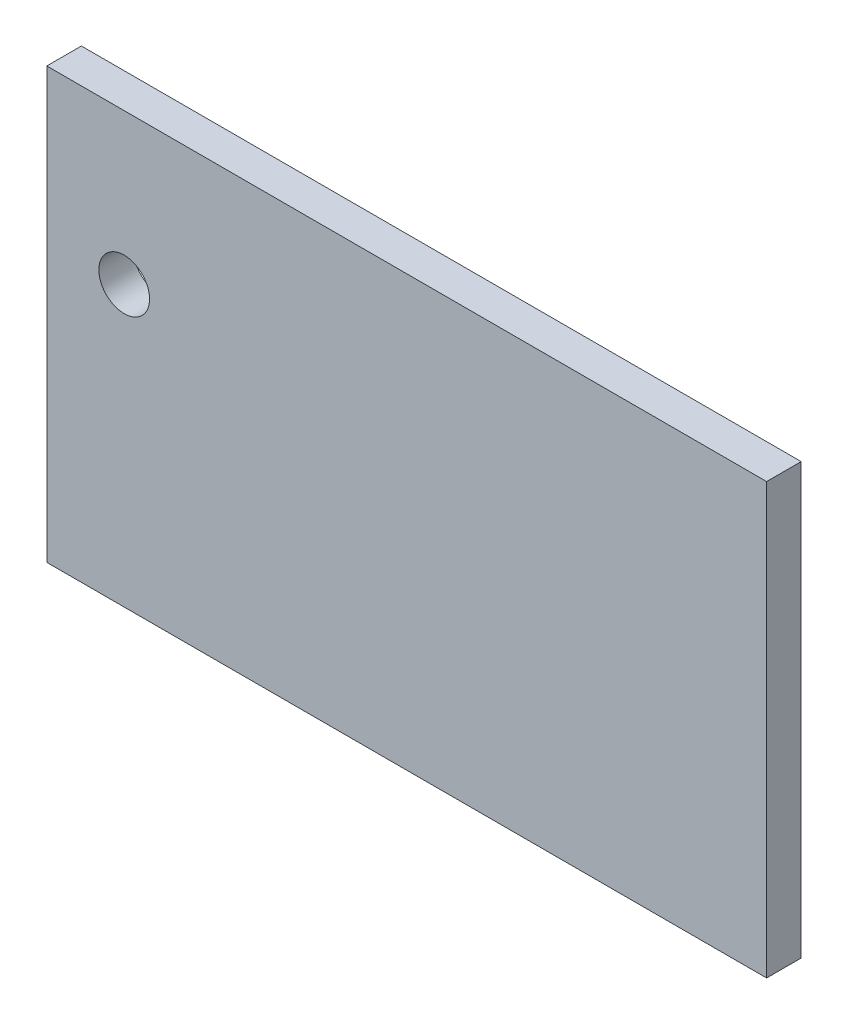
ISO-10303-21;
HEADER;
FILE_DESCRIPTION(('STEP AP214'),'2;1');
FILE_NAME('part.step','',(''),(''),'','','');
FILE_SCHEMA(('AUTOMOTIVE_DESIGN { 1 0 10303 214 1 1 1 1 }'));
ENDSEC;
DATA;
#1=APPLICATION_CONTEXT('core data for automotive mechanical design processes');
#2=APPLICATION_PROTOCOL_DEFINITION('international standard','automotive_design',2000,#1);
#3=PRODUCT_CONTEXT('',#1,'mechanical');
#4=PRODUCT('Part','Part','',(#3));
#5=PRODUCT_RELATED_PRODUCT_CATEGORY('part','',(#4));
#6=PRODUCT_DEFINITION_FORMATION('','',#4);
#7=PRODUCT_DEFINITION_CONTEXT('part definition',#1,'design');
#8=PRODUCT_DEFINITION('design','',#6,#7);
#9=PRODUCT_DEFINITION_SHAPE('','',#8);
#10=(LENGTH_UNIT() NAMED_UNIT(*) SI_UNIT(.MILLI.,.METRE.));
#11=(NAMED_UNIT(*) PLANE_ANGLE_UNIT() SI_UNIT($,.RADIAN.));
#12=(NAMED_UNIT(*) SI_UNIT($,.STERADIAN.) SOLID_ANGLE_UNIT());
#13=UNCERTAINTY_MEASURE_WITH_UNIT(LENGTH_MEASURE(1.E-05),#10,'distance_accuracy_value','');
#14=(GEOMETRIC_REPRESENTATION_CONTEXT(3) GLOBAL_UNCERTAINTY_ASSIGNED_CONTEXT((#13)) GLOBAL_UNIT_ASSIGNED_CONTEXT((#10,
#11,#12)) REPRESENTATION_CONTEXT('',''));
#15=CARTESIAN_POINT('',(0.,0.,0.));
#16=DIRECTION('',(0.,0.,1.));
#17=DIRECTION('',(1.,0.,0.));
#18=AXIS2_PLACEMENT_3D('',#15,#16,#17);
#19=CARTESIAN_POINT('',(0.,0.,6.135));
#20=DIRECTION('',(1.,0.,0.));
#21=DIRECTION('',(0.,0.,-1.));
#22=AXIS2_PLACEMENT_3D('',#19,#20,#21);
#23=PLANE('',#22);
#24=DIRECTION('',(0.,-1.,0.));
#25=VECTOR('',#24,1.);
#26=CARTESIAN_POINT('',(0.,0.,0.));
#27=LINE('',#26,#25);
#28=CARTESIAN_POINT('',(0.,76.2960381390761,0.));
#29=VERTEX_POINT('',#28);
#30=CARTESIAN_POINT('',(0.,0.,0.));
#31=VERTEX_POINT('',#30);
#32=EDGE_CURVE('E107',#29,#31,#27,.T.);
#33=ORIENTED_EDGE('',*,*,#32,.T.);
#34=DIRECTION('',(0.,0.,-1.));
#35=VECTOR('',#34,1.);
#36=CARTESIAN_POINT('',(0.,0.,6.135));
#37=LINE('',#36,#35);
#38=CARTESIAN_POINT('',(0.,0.,6.135));
#39=VERTEX_POINT('',#38);
#40=EDGE_CURVE('E11',#39,#31,#37,.T.);
#41=ORIENTED_EDGE('',*,*,#40,.F.);
#42=DIRECTION('',(0.,-1.,0.));
#43=VECTOR('',#42,1.);
#44=CARTESIAN_POINT('',(0.,0.,6.135));
#45=LINE('',#44,#43);
#46=CARTESIAN_POINT('',(0.,76.2960381390761,6.135));
#47=VERTEX_POINT('',#46);
#48=EDGE_CURVE('E91',#47,#39,#45,.T.);
#49=ORIENTED_EDGE('',*,*,#48,.F.);
#50=DIRECTION('',(0.,0.,-1.));
#51=VECTOR('',#50,1.);
#52=CARTESIAN_POINT('',(0.,76.2960381390761,6.135));
#53=LINE('',#52,#51);
#54=EDGE_CURVE('E103',#47,#29,#53,.T.);
#55=ORIENTED_EDGE('',*,*,#54,.T.);
#56=EDGE_LOOP('',(#33,#41,#49,#55));
#57=FACE_BOUND('',#56,.T.);
#58=ADVANCED_FACE('F39',(#57),#23,.F.);
#59=CARTESIAN_POINT('',(0.,0.,6.135));
#60=DIRECTION('',(0.,1.,0.));
#61=DIRECTION('',(0.,0.,1.));
#62=AXIS2_PLACEMENT_3D('',#59,#60,#61);
#63=PLANE('',#62);
#64=DIRECTION('',(1.,0.,0.));
#65=VECTOR('',#64,1.);
#66=CARTESIAN_POINT('',(0.,0.,0.));
#67=LINE('',#66,#65);
#68=CARTESIAN_POINT('',(127.73907611376,0.,0.));
#69=VERTEX_POINT('',#68);
#70=EDGE_CURVE('E96',#31,#69,#67,.T.);
#71=ORIENTED_EDGE('',*,*,#70,.T.);
#72=DIRECTION('',(0.,0.,-1.));
#73=VECTOR('',#72,1.);
#74=CARTESIAN_POINT('',(127.73907611376,0.,6.135));
#75=LINE('',#74,#73);
#76=CARTESIAN_POINT('',(127.73907611376,0.,6.135));
#77=VERTEX_POINT('',#76);
#78=EDGE_CURVE('E48',#77,#69,#75,.T.);
#79=ORIENTED_EDGE('',*,*,#78,.F.);
#80=DIRECTION('',(1.,0.,0.));
#81=VECTOR('',#80,1.);
#82=CARTESIAN_POINT('',(0.,0.,6.135));
#83=LINE('',#82,#81);
#84=EDGE_CURVE('E86',#39,#77,#83,.T.);
#85=ORIENTED_EDGE('',*,*,#84,.F.);
#86=ORIENTED_EDGE('',*,*,#40,.T.);
#87=EDGE_LOOP('',(#71,#79,#85,#86));
#88=FACE_BOUND('',#87,.T.);
#89=ADVANCED_FACE('F95',(#88),#63,.F.);
#90=CARTESIAN_POINT('',(127.73907611376,0.,6.135));
#91=DIRECTION('',(-1.,0.,0.));
#92=DIRECTION('',(0.,0.,1.));
#93=AXIS2_PLACEMENT_3D('',#90,#91,#92);
#94=PLANE('',#93);
#95=DIRECTION('',(0.,1.,0.));
#96=VECTOR('',#95,1.);
#97=CARTESIAN_POINT('',(127.73907611376,0.,0.));
#98=LINE('',#97,#96);
#99=CARTESIAN_POINT('',(127.73907611376,76.2960381390761,0.));
#100=VERTEX_POINT('',#99);
#101=EDGE_CURVE('E73',#69,#100,#98,.T.);
#102=ORIENTED_EDGE('',*,*,#101,.T.);
#103=DIRECTION('',(0.,0.,-1.));
#104=VECTOR('',#103,1.);
#105=CARTESIAN_POINT('',(127.73907611376,76.2960381390761,6.135));
#106=LINE('',#105,#104);
#107=CARTESIAN_POINT('',(127.73907611376,76.2960381390761,6.135));
#108=VERTEX_POINT('',#107);
#109=EDGE_CURVE('E98',#108,#100,#106,.T.);
#110=ORIENTED_EDGE('',*,*,#109,.F.);
#111=DIRECTION('',(0.,1.,0.));
#112=VECTOR('',#111,1.);
#113=CARTESIAN_POINT('',(127.73907611376,0.,6.135));
#114=LINE('',#113,#112);
#115=EDGE_CURVE('E89',#77,#108,#114,.T.);
#116=ORIENTED_EDGE('',*,*,#115,.F.);
#117=ORIENTED_EDGE('',*,*,#78,.T.);
#118=EDGE_LOOP('',(#102,#110,#116,#117));
#119=FACE_BOUND('',#118,.T.);
#120=ADVANCED_FACE('F99',(#119),#94,.F.);
#121=CARTESIAN_POINT('',(0.,76.2960381390761,6.135));
#122=DIRECTION('',(0.,-1.,0.));
#123=DIRECTION('',(0.,0.,-1.));
#124=AXIS2_PLACEMENT_3D('',#121,#122,#123);
#125=PLANE('',#124);
#126=DIRECTION('',(-1.,0.,0.));
#127=VECTOR('',#126,1.);
#128=CARTESIAN_POINT('',(0.,76.2960381390761,0.));
#129=LINE('',#128,#127);
#130=EDGE_CURVE('E79',#100,#29,#129,.T.);
#131=ORIENTED_EDGE('',*,*,#130,.T.);
#132=ORIENTED_EDGE('',*,*,#54,.F.);
#133=DIRECTION('',(-1.,0.,0.));
#134=VECTOR('',#133,1.);
#135=CARTESIAN_POINT('',(0.,76.2960381390761,6.135));
#136=LINE('',#135,#134);
#137=EDGE_CURVE('E56',#108,#47,#136,.T.);
#138=ORIENTED_EDGE('',*,*,#137,.F.);
#139=ORIENTED_EDGE('',*,*,#109,.T.);
#140=EDGE_LOOP('',(#131,#132,#138,#139));
#141=FACE_BOUND('',#140,.T.);
#142=ADVANCED_FACE('F121',(#141),#125,.F.);
#143=CARTESIAN_POINT('',(0.,0.,6.135));
#144=DIRECTION('',(0.,0.,-1.));
#145=DIRECTION('',(-1.,0.,0.));
#146=AXIS2_PLACEMENT_3D('',#143,#144,#145);
#147=PLANE('',#146);
#148=CARTESIAN_POINT('',(13.7347644673014,49.5908889184307,6.135));
#149=DIRECTION('',(0.,0.,1.));
#150=DIRECTION('',(1.,0.,0.));
#151=AXIS2_PLACEMENT_3D('',#148,#149,#150);
#152=CIRCLE('',#151,4.5);
#153=CARTESIAN_POINT('',(18.2347644673014,49.5908889184307,6.135));
#154=VERTEX_POINT('',#153);
#155=EDGE_CURVE('E128',#154,#154,#152,.T.);
#156=ORIENTED_EDGE('',*,*,#155,.F.);
#157=EDGE_LOOP('',(#156));
#158=FACE_BOUND('',#157,.T.);
#159=ORIENTED_EDGE('',*,*,#48,.T.);
#160=ORIENTED_EDGE('',*,*,#84,.T.);
#161=ORIENTED_EDGE('',*,*,#115,.T.);
#162=ORIENTED_EDGE('',*,*,#137,.T.);
#163=EDGE_LOOP('',(#159,#160,#161,#162));
#164=FACE_BOUND('',#163,.T.);
#165=ADVANCED_FACE('F87',(#158,#164),#147,.F.);
#166=CARTESIAN_POINT('',(0.,0.,0.));
#167=DIRECTION('',(0.,0.,-1.));
#168=DIRECTION('',(-1.,0.,0.));
#169=AXIS2_PLACEMENT_3D('',#166,#167,#168);
#170=PLANE('',#169);
#171=CARTESIAN_POINT('',(13.7347644673014,49.5908889184307,0.));
#172=DIRECTION('',(0.,0.,1.));
#173=DIRECTION('',(1.,0.,0.));
#174=AXIS2_PLACEMENT_3D('',#171,#172,#173);
#175=CIRCLE('',#174,4.5);
#176=CARTESIAN_POINT('',(18.2347644673014,49.5908889184307,0.));
#177=VERTEX_POINT('',#176);
#178=EDGE_CURVE('E111',#177,#177,#175,.T.);
#179=ORIENTED_EDGE('',*,*,#178,.T.);
#180=EDGE_LOOP('',(#179));
#181=FACE_BOUND('',#180,.T.);
#182=ORIENTED_EDGE('',*,*,#32,.F.);
#183=ORIENTED_EDGE('',*,*,#130,.F.);
#184=ORIENTED_EDGE('',*,*,#101,.F.);
#185=ORIENTED_EDGE('',*,*,#70,.F.);
#186=EDGE_LOOP('',(#182,#183,#184,#185));
#187=FACE_BOUND('',#186,.T.);
#188=ADVANCED_FACE('F124',(#181,#187),#170,.T.);
#189=CARTESIAN_POINT('',(13.7347644673014,49.5908889184307,0.));
#190=DIRECTION('',(0.,0.,1.));
#191=DIRECTION('',(1.,0.,0.));
#192=AXIS2_PLACEMENT_3D('',#189,#190,#191);
#193=CYLINDRICAL_SURFACE('',#192,4.5);
#194=ORIENTED_EDGE('',*,*,#178,.F.);
#195=EDGE_LOOP('',(#194));
#196=FACE_BOUND('',#195,.T.);
#197=ORIENTED_EDGE('',*,*,#155,.T.);
#198=EDGE_LOOP('',(#197));
#199=FACE_BOUND('',#198,.T.);
#200=ADVANCED_FACE('F137',(#196,#199),#193,.F.);
#201=CLOSED_SHELL('',(#58,#89,#120,#142,#165,#188,#200));
#202=MANIFOLD_SOLID_BREP('B2',#201);
#203=ADVANCED_BREP_SHAPE_REPRESENTATION('',(#18,#202),#14);
#204=SHAPE_DEFINITION_REPRESENTATION(#9,#203);
ENDSEC;
END-ISO-10303-21;
